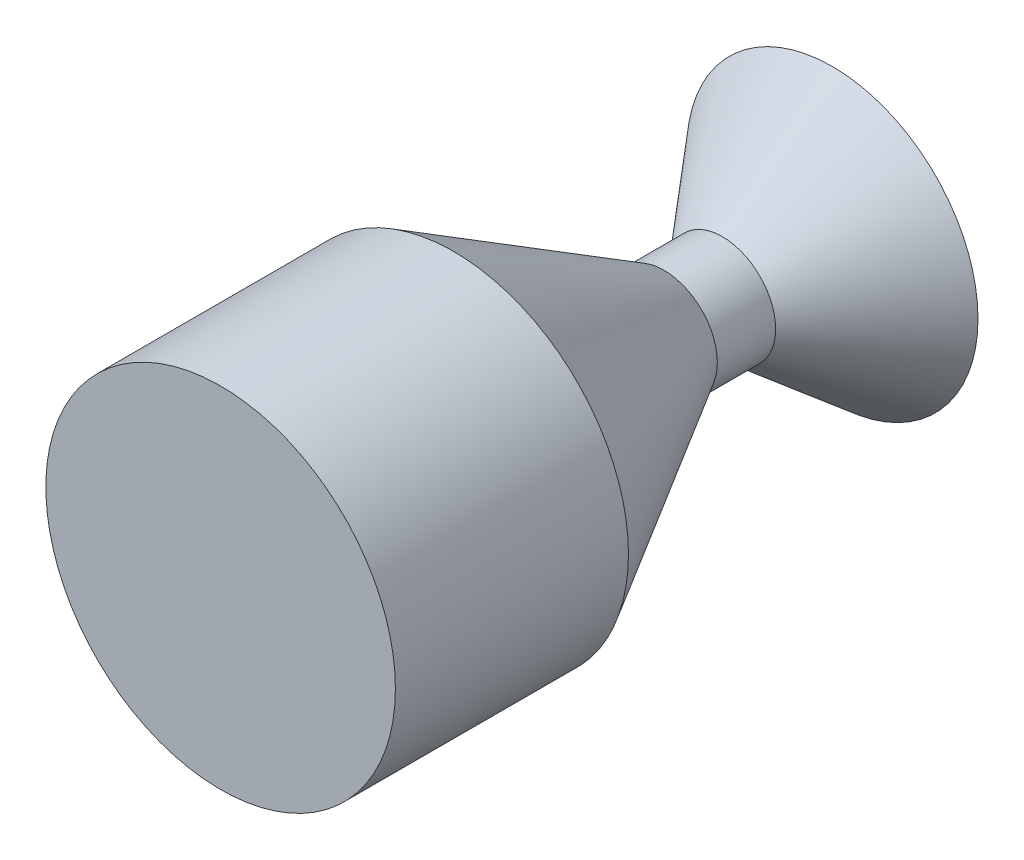
ISO-10303-21;
HEADER;
FILE_DESCRIPTION(('STEP AP214'),'2;1');
FILE_NAME('part.step','',(''),(''),'','','');
FILE_SCHEMA(('AUTOMOTIVE_DESIGN { 1 0 10303 214 1 1 1 1 }'));
ENDSEC;
DATA;
#1=APPLICATION_CONTEXT('core data for automotive mechanical design processes');
#2=APPLICATION_PROTOCOL_DEFINITION('international standard','automotive_design',2000,#1);
#3=PRODUCT_CONTEXT('',#1,'mechanical');
#4=PRODUCT('Part','Part','',(#3));
#5=PRODUCT_RELATED_PRODUCT_CATEGORY('part','',(#4));
#6=PRODUCT_DEFINITION_FORMATION('','',#4);
#7=PRODUCT_DEFINITION_CONTEXT('part definition',#1,'design');
#8=PRODUCT_DEFINITION('design','',#6,#7);
#9=PRODUCT_DEFINITION_SHAPE('','',#8);
#10=(LENGTH_UNIT() NAMED_UNIT(*) SI_UNIT(.MILLI.,.METRE.));
#11=(NAMED_UNIT(*) PLANE_ANGLE_UNIT() SI_UNIT($,.RADIAN.));
#12=(NAMED_UNIT(*) SI_UNIT($,.STERADIAN.) SOLID_ANGLE_UNIT());
#13=UNCERTAINTY_MEASURE_WITH_UNIT(LENGTH_MEASURE(1.E-05),#10,'distance_accuracy_value','');
#14=(GEOMETRIC_REPRESENTATION_CONTEXT(3) GLOBAL_UNCERTAINTY_ASSIGNED_CONTEXT((#13)) GLOBAL_UNIT_ASSIGNED_CONTEXT((#10,
#11,#12)) REPRESENTATION_CONTEXT('',''));
#15=CARTESIAN_POINT('',(0.,0.,0.));
#16=DIRECTION('',(0.,0.,1.));
#17=DIRECTION('',(1.,0.,0.));
#18=AXIS2_PLACEMENT_3D('',#15,#16,#17);
#19=CARTESIAN_POINT('',(30.,0.,0.));
#20=DIRECTION('',(0.,0.,1.));
#21=DIRECTION('',(1.,0.,0.));
#22=AXIS2_PLACEMENT_3D('',#19,#20,#21);
#23=PLANE('',#22);
#24=CARTESIAN_POINT('',(0.,0.,0.));
#25=DIRECTION('',(0.,0.,1.));
#26=DIRECTION('',(1.,0.,0.));
#27=AXIS2_PLACEMENT_3D('',#24,#25,#26);
#28=CIRCLE('',#27,30.);
#29=CARTESIAN_POINT('',(30.,0.,0.));
#30=VERTEX_POINT('',#29);
#31=EDGE_CURVE('E50',#30,#30,#28,.T.);
#32=ORIENTED_EDGE('',*,*,#31,.T.);
#33=EDGE_LOOP('',(#32));
#34=FACE_BOUND('',#33,.T.);
#35=ADVANCED_FACE('F31',(#34),#23,.T.);
#36=CARTESIAN_POINT('',(0.,0.,-105.));
#37=DIRECTION('',(0.,0.,-1.));
#38=DIRECTION('',(-1.,0.,0.));
#39=AXIS2_PLACEMENT_3D('',#36,#37,#38);
#40=PLANE('',#39);
#41=CARTESIAN_POINT('',(0.,0.,-105.));
#42=DIRECTION('',(0.,0.,1.));
#43=DIRECTION('',(1.,0.,0.));
#44=AXIS2_PLACEMENT_3D('',#41,#42,#43);
#45=CIRCLE('',#44,25.);
#46=CARTESIAN_POINT('',(25.,0.,-105.));
#47=VERTEX_POINT('',#46);
#48=EDGE_CURVE('E10',#47,#47,#45,.T.);
#49=ORIENTED_EDGE('',*,*,#48,.F.);
#50=EDGE_LOOP('',(#49));
#51=FACE_BOUND('',#50,.T.);
#52=ADVANCED_FACE('F67',(#51),#40,.T.);
#53=CARTESIAN_POINT('',(0.,0.,-86.1117464878219));
#54=DIRECTION('',(0.,0.,-1.));
#55=DIRECTION('',(-1.,0.,0.));
#56=AXIS2_PLACEMENT_3D('',#53,#54,#55);
#57=CONICAL_SURFACE('',#56,9.15087344434823,0.698131700797738);
#58=ORIENTED_EDGE('',*,*,#48,.T.);
#59=EDGE_LOOP('',(#58));
#60=FACE_BOUND('',#59,.T.);
#61=CARTESIAN_POINT('',(0.,0.,-86.1117464878219));
#62=DIRECTION('',(0.,0.,1.));
#63=DIRECTION('',(1.,0.,0.));
#64=AXIS2_PLACEMENT_3D('',#61,#62,#63);
#65=CIRCLE('',#64,9.15087344434823);
#66=CARTESIAN_POINT('',(9.15087344434823,0.,-86.1117464878219));
#67=VERTEX_POINT('',#66);
#68=EDGE_CURVE('E37',#67,#67,#65,.T.);
#69=ORIENTED_EDGE('',*,*,#68,.F.);
#70=EDGE_LOOP('',(#69));
#71=FACE_BOUND('',#70,.T.);
#72=ADVANCED_FACE('F71',(#60,#71),#57,.T.);
#73=CARTESIAN_POINT('',(0.,0.,0.));
#74=DIRECTION('',(0.,0.,1.));
#75=DIRECTION('',(1.,0.,0.));
#76=AXIS2_PLACEMENT_3D('',#73,#74,#75);
#77=CYLINDRICAL_SURFACE('',#76,9.15087344434804);
#78=ORIENTED_EDGE('',*,*,#68,.T.);
#79=EDGE_LOOP('',(#78));
#80=FACE_BOUND('',#79,.T.);
#81=CARTESIAN_POINT('',(0.,0.,-76.1117464878217));
#82=DIRECTION('',(0.,0.,1.));
#83=DIRECTION('',(1.,0.,0.));
#84=AXIS2_PLACEMENT_3D('',#81,#82,#83);
#85=CIRCLE('',#84,9.15087344434785);
#86=CARTESIAN_POINT('',(9.15087344434785,0.,-76.1117464878217));
#87=VERTEX_POINT('',#86);
#88=EDGE_CURVE('E41',#87,#87,#85,.T.);
#89=ORIENTED_EDGE('',*,*,#88,.F.);
#90=EDGE_LOOP('',(#89));
#91=FACE_BOUND('',#90,.T.);
#92=ADVANCED_FACE('F63',(#80,#91),#77,.T.);
#93=CARTESIAN_POINT('',(0.,0.,-40.));
#94=DIRECTION('',(0.,0.,1.));
#95=DIRECTION('',(1.,0.,0.));
#96=AXIS2_PLACEMENT_3D('',#93,#94,#95);
#97=CONICAL_SURFACE('',#96,30.,0.523598775598314);
#98=ORIENTED_EDGE('',*,*,#88,.T.);
#99=EDGE_LOOP('',(#98));
#100=FACE_BOUND('',#99,.T.);
#101=CARTESIAN_POINT('',(0.,0.,-40.));
#102=DIRECTION('',(0.,0.,1.));
#103=DIRECTION('',(1.,0.,0.));
#104=AXIS2_PLACEMENT_3D('',#101,#102,#103);
#105=CIRCLE('',#104,30.);
#106=CARTESIAN_POINT('',(30.,0.,-40.));
#107=VERTEX_POINT('',#106);
#108=EDGE_CURVE('E45',#107,#107,#105,.T.);
#109=ORIENTED_EDGE('',*,*,#108,.F.);
#110=EDGE_LOOP('',(#109));
#111=FACE_BOUND('',#110,.T.);
#112=ADVANCED_FACE('F57',(#100,#111),#97,.T.);
#113=CARTESIAN_POINT('',(0.,0.,0.));
#114=DIRECTION('',(0.,0.,1.));
#115=DIRECTION('',(1.,0.,0.));
#116=AXIS2_PLACEMENT_3D('',#113,#114,#115);
#117=CYLINDRICAL_SURFACE('',#116,30.);
#118=ORIENTED_EDGE('',*,*,#108,.T.);
#119=EDGE_LOOP('',(#118));
#120=FACE_BOUND('',#119,.T.);
#121=ORIENTED_EDGE('',*,*,#31,.F.);
#122=EDGE_LOOP('',(#121));
#123=FACE_BOUND('',#122,.T.);
#124=ADVANCED_FACE('F55',(#120,#123),#117,.T.);
#125=CLOSED_SHELL('',(#35,#52,#72,#92,#112,#124));
#126=MANIFOLD_SOLID_BREP('B2',#125);
#127=ADVANCED_BREP_SHAPE_REPRESENTATION('',(#18,#126),#14);
#128=SHAPE_DEFINITION_REPRESENTATION(#9,#127);
ENDSEC;
END-ISO-10303-21;
